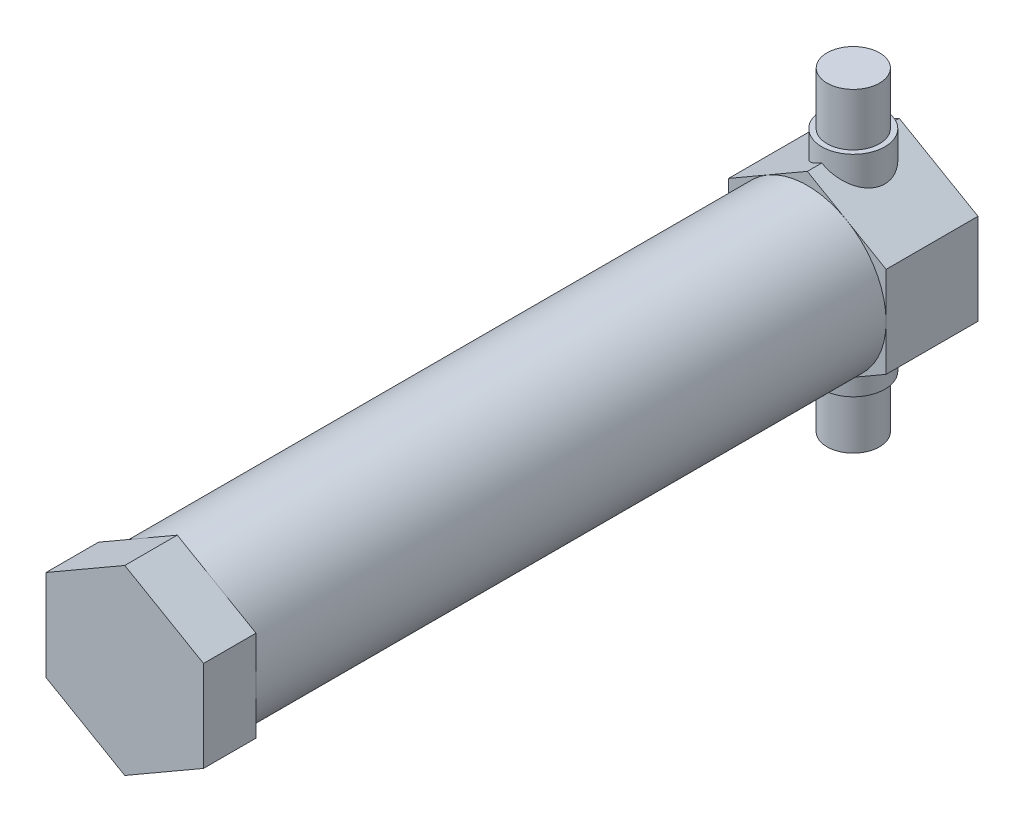
ISO-10303-21;
HEADER;
FILE_DESCRIPTION(('STEP AP214'),'2;1');
FILE_NAME('part.step','',(''),(''),'','','');
FILE_SCHEMA(('AUTOMOTIVE_DESIGN { 1 0 10303 214 1 1 1 1 }'));
ENDSEC;
DATA;
#1=APPLICATION_CONTEXT('core data for automotive mechanical design processes');
#2=APPLICATION_PROTOCOL_DEFINITION('international standard','automotive_design',2000,#1);
#3=PRODUCT_CONTEXT('',#1,'mechanical');
#4=PRODUCT('Part','Part','',(#3));
#5=PRODUCT_RELATED_PRODUCT_CATEGORY('part','',(#4));
#6=PRODUCT_DEFINITION_FORMATION('','',#4);
#7=PRODUCT_DEFINITION_CONTEXT('part definition',#1,'design');
#8=PRODUCT_DEFINITION('design','',#6,#7);
#9=PRODUCT_DEFINITION_SHAPE('','',#8);
#10=(LENGTH_UNIT() NAMED_UNIT(*) SI_UNIT(.MILLI.,.METRE.));
#11=(NAMED_UNIT(*) PLANE_ANGLE_UNIT() SI_UNIT($,.RADIAN.));
#12=(NAMED_UNIT(*) SI_UNIT($,.STERADIAN.) SOLID_ANGLE_UNIT());
#13=UNCERTAINTY_MEASURE_WITH_UNIT(LENGTH_MEASURE(1.E-05),#10,'distance_accuracy_value','');
#14=(GEOMETRIC_REPRESENTATION_CONTEXT(3) GLOBAL_UNCERTAINTY_ASSIGNED_CONTEXT((#13)) GLOBAL_UNIT_ASSIGNED_CONTEXT((#10,
#11,#12)) REPRESENTATION_CONTEXT('',''));
#15=CARTESIAN_POINT('',(0.,0.,0.));
#16=DIRECTION('',(0.,0.,1.));
#17=DIRECTION('',(1.,0.,0.));
#18=AXIS2_PLACEMENT_3D('',#15,#16,#17);
#19=CARTESIAN_POINT('',(0.,0.,93.6625));
#20=DIRECTION('',(0.,0.,-1.));
#21=DIRECTION('',(-1.,0.,0.));
#22=AXIS2_PLACEMENT_3D('',#19,#20,#21);
#23=CYLINDRICAL_SURFACE('',#22,9.525);
#24=CARTESIAN_POINT('',(0.,0.,87.3125));
#25=DIRECTION('',(0.,0.,1.));
#26=DIRECTION('',(1.,0.,0.));
#27=AXIS2_PLACEMENT_3D('',#24,#25,#26);
#28=CIRCLE('',#27,9.525);
#29=CARTESIAN_POINT('',(9.525,0.,87.3125));
#30=VERTEX_POINT('',#29);
#31=CARTESIAN_POINT('',(4.7625,8.24889197104678,87.3125));
#32=VERTEX_POINT('',#31);
#33=EDGE_CURVE('E260',#30,#32,#28,.T.);
#34=ORIENTED_EDGE('',*,*,#33,.F.);
#35=CARTESIAN_POINT('',(4.7625,-8.24889197104678,87.3125));
#36=VERTEX_POINT('',#35);
#37=EDGE_CURVE('E242',#36,#30,#28,.T.);
#38=ORIENTED_EDGE('',*,*,#37,.F.);
#39=CARTESIAN_POINT('',(-4.7625,-8.24889197104678,87.3125));
#40=VERTEX_POINT('',#39);
#41=EDGE_CURVE('E259',#40,#36,#28,.T.);
#42=ORIENTED_EDGE('',*,*,#41,.F.);
#43=CARTESIAN_POINT('',(-9.525,0.,87.3125));
#44=VERTEX_POINT('',#43);
#45=EDGE_CURVE('E435',#44,#40,#28,.T.);
#46=ORIENTED_EDGE('',*,*,#45,.F.);
#47=CARTESIAN_POINT('',(-4.7625,8.24889197104678,87.3125));
#48=VERTEX_POINT('',#47);
#49=EDGE_CURVE('E436',#48,#44,#28,.T.);
#50=ORIENTED_EDGE('',*,*,#49,.F.);
#51=EDGE_CURVE('E414',#32,#48,#28,.T.);
#52=ORIENTED_EDGE('',*,*,#51,.F.);
#53=EDGE_LOOP('',(#34,#38,#42,#46,#50,#52));
#54=FACE_BOUND('',#53,.T.);
#55=CARTESIAN_POINT('',(0.,0.,11.1125));
#56=DIRECTION('',(0.,0.,-1.));
#57=DIRECTION('',(-1.,0.,0.));
#58=AXIS2_PLACEMENT_3D('',#55,#56,#57);
#59=CIRCLE('',#58,9.525);
#60=CARTESIAN_POINT('',(-9.525,0.,11.1125));
#61=VERTEX_POINT('',#60);
#62=CARTESIAN_POINT('',(-4.7625,8.24889197104678,11.1125));
#63=VERTEX_POINT('',#62);
#64=EDGE_CURVE('E265',#61,#63,#59,.T.);
#65=ORIENTED_EDGE('',*,*,#64,.F.);
#66=CARTESIAN_POINT('',(-4.7625,-8.24889197104678,11.1125));
#67=VERTEX_POINT('',#66);
#68=EDGE_CURVE('E261',#67,#61,#59,.T.);
#69=ORIENTED_EDGE('',*,*,#68,.F.);
#70=CARTESIAN_POINT('',(4.7625,-8.24889197104678,11.1125));
#71=VERTEX_POINT('',#70);
#72=EDGE_CURVE('E264',#71,#67,#59,.T.);
#73=ORIENTED_EDGE('',*,*,#72,.F.);
#74=CARTESIAN_POINT('',(9.525,0.,11.1125));
#75=VERTEX_POINT('',#74);
#76=EDGE_CURVE('E370',#75,#71,#59,.T.);
#77=ORIENTED_EDGE('',*,*,#76,.F.);
#78=CARTESIAN_POINT('',(4.7625,8.24889197104678,11.1125));
#79=VERTEX_POINT('',#78);
#80=EDGE_CURVE('E359',#79,#75,#59,.T.);
#81=ORIENTED_EDGE('',*,*,#80,.F.);
#82=EDGE_CURVE('E354',#63,#79,#59,.T.);
#83=ORIENTED_EDGE('',*,*,#82,.F.);
#84=EDGE_LOOP('',(#65,#69,#73,#77,#81,#83));
#85=FACE_BOUND('',#84,.T.);
#86=ADVANCED_FACE('F41',(#54,#85),#23,.T.);
#87=CARTESIAN_POINT('',(0.,0.,87.3125));
#88=DIRECTION('',(0.,0.,1.));
#89=DIRECTION('',(1.,0.,0.));
#90=AXIS2_PLACEMENT_3D('',#87,#88,#89);
#91=PLANE('',#90);
#92=DIRECTION('',(0.,1.,0.));
#93=VECTOR('',#92,1.);
#94=CARTESIAN_POINT('',(9.525,-5.49926131403118,87.3125));
#95=LINE('',#94,#93);
#96=CARTESIAN_POINT('',(9.525,5.49926131403119,87.3125));
#97=VERTEX_POINT('',#96);
#98=EDGE_CURVE('E205',#30,#97,#95,.T.);
#99=ORIENTED_EDGE('',*,*,#98,.F.);
#100=ORIENTED_EDGE('',*,*,#33,.T.);
#101=DIRECTION('',(-0.866025403784438,0.5,0.));
#102=VECTOR('',#101,1.);
#103=CARTESIAN_POINT('',(9.525,5.49926131403119,87.3125));
#104=LINE('',#103,#102);
#105=EDGE_CURVE('E206',#97,#32,#104,.T.);
#106=ORIENTED_EDGE('',*,*,#105,.F.);
#107=EDGE_LOOP('',(#99,#100,#106));
#108=FACE_BOUND('',#107,.T.);
#109=ADVANCED_FACE('F400',(#108),#91,.F.);
#110=CARTESIAN_POINT('',(0.,10.9985226280624,87.3125));
#111=VERTEX_POINT('',#110);
#112=EDGE_CURVE('E204',#32,#111,#104,.T.);
#113=ORIENTED_EDGE('',*,*,#112,.F.);
#114=ORIENTED_EDGE('',*,*,#51,.T.);
#115=DIRECTION('',(-0.866025403784438,-0.5,0.));
#116=VECTOR('',#115,1.);
#117=CARTESIAN_POINT('',(0.,10.9985226280624,87.3125));
#118=LINE('',#117,#116);
#119=EDGE_CURVE('E210',#111,#48,#118,.T.);
#120=ORIENTED_EDGE('',*,*,#119,.F.);
#121=EDGE_LOOP('',(#113,#114,#120));
#122=FACE_BOUND('',#121,.T.);
#123=ADVANCED_FACE('F407',(#122),#91,.F.);
#124=CARTESIAN_POINT('',(-9.525,5.49926131403119,87.3125));
#125=VERTEX_POINT('',#124);
#126=EDGE_CURVE('E209',#48,#125,#118,.T.);
#127=ORIENTED_EDGE('',*,*,#126,.F.);
#128=ORIENTED_EDGE('',*,*,#49,.T.);
#129=DIRECTION('',(0.,-1.,0.));
#130=VECTOR('',#129,1.);
#131=CARTESIAN_POINT('',(-9.525,5.49926131403119,87.3125));
#132=LINE('',#131,#130);
#133=EDGE_CURVE('E214',#125,#44,#132,.T.);
#134=ORIENTED_EDGE('',*,*,#133,.F.);
#135=EDGE_LOOP('',(#127,#128,#134));
#136=FACE_BOUND('',#135,.T.);
#137=ADVANCED_FACE('F446',(#136),#91,.F.);
#138=CARTESIAN_POINT('',(-9.525,-5.49926131403118,87.3125));
#139=VERTEX_POINT('',#138);
#140=EDGE_CURVE('E213',#44,#139,#132,.T.);
#141=ORIENTED_EDGE('',*,*,#140,.F.);
#142=ORIENTED_EDGE('',*,*,#45,.T.);
#143=DIRECTION('',(0.866025403784438,-0.5,0.));
#144=VECTOR('',#143,1.);
#145=CARTESIAN_POINT('',(-9.525,-5.49926131403118,87.3125));
#146=LINE('',#145,#144);
#147=EDGE_CURVE('E218',#139,#40,#146,.T.);
#148=ORIENTED_EDGE('',*,*,#147,.F.);
#149=EDGE_LOOP('',(#141,#142,#148));
#150=FACE_BOUND('',#149,.T.);
#151=ADVANCED_FACE('F462',(#150),#91,.F.);
#152=CARTESIAN_POINT('',(0.,-10.9985226280624,87.3125));
#153=VERTEX_POINT('',#152);
#154=EDGE_CURVE('E217',#40,#153,#146,.T.);
#155=ORIENTED_EDGE('',*,*,#154,.F.);
#156=ORIENTED_EDGE('',*,*,#41,.T.);
#157=DIRECTION('',(0.866025403784439,0.5,0.));
#158=VECTOR('',#157,1.);
#159=CARTESIAN_POINT('',(0.,-10.9985226280624,87.3125));
#160=LINE('',#159,#158);
#161=EDGE_CURVE('E222',#153,#36,#160,.T.);
#162=ORIENTED_EDGE('',*,*,#161,.F.);
#163=EDGE_LOOP('',(#155,#156,#162));
#164=FACE_BOUND('',#163,.T.);
#165=ADVANCED_FACE('F433',(#164),#91,.F.);
#166=CARTESIAN_POINT('',(9.525,-5.49926131403118,87.3125));
#167=DIRECTION('',(1.,0.,0.));
#168=DIRECTION('',(0.,0.,-1.));
#169=AXIS2_PLACEMENT_3D('',#166,#167,#168);
#170=PLANE('',#169);
#171=CARTESIAN_POINT('',(9.525,-5.49926131403118,87.3125));
#172=VERTEX_POINT('',#171);
#173=EDGE_CURVE('E201',#172,#30,#95,.T.);
#174=ORIENTED_EDGE('',*,*,#173,.T.);
#175=ORIENTED_EDGE('',*,*,#98,.T.);
#176=DIRECTION('',(0.,0.,1.));
#177=VECTOR('',#176,1.);
#178=CARTESIAN_POINT('',(9.525,5.49926131403119,87.3125));
#179=LINE('',#178,#177);
#180=CARTESIAN_POINT('',(9.525,5.49926131403119,93.6625));
#181=VERTEX_POINT('',#180);
#182=EDGE_CURVE('E225',#97,#181,#179,.T.);
#183=ORIENTED_EDGE('',*,*,#182,.T.);
#184=DIRECTION('',(0.,1.,0.));
#185=VECTOR('',#184,1.);
#186=CARTESIAN_POINT('',(9.525,-5.49926131403118,93.6625));
#187=LINE('',#186,#185);
#188=CARTESIAN_POINT('',(9.525,-5.49926131403118,93.6625));
#189=VERTEX_POINT('',#188);
#190=EDGE_CURVE('E226',#189,#181,#187,.T.);
#191=ORIENTED_EDGE('',*,*,#190,.F.);
#192=DIRECTION('',(0.,0.,1.));
#193=VECTOR('',#192,1.);
#194=CARTESIAN_POINT('',(9.525,-5.49926131403118,87.3125));
#195=LINE('',#194,#193);
#196=EDGE_CURVE('E239',#172,#189,#195,.T.);
#197=ORIENTED_EDGE('',*,*,#196,.F.);
#198=EDGE_LOOP('',(#174,#175,#183,#191,#197));
#199=FACE_BOUND('',#198,.T.);
#200=ADVANCED_FACE('F424',(#199),#170,.T.);
#201=CARTESIAN_POINT('',(0.,-10.9985226280624,87.3125));
#202=DIRECTION('',(0.5,-0.866025403784439,0.));
#203=DIRECTION('',(0.866025403784439,0.5,0.));
#204=AXIS2_PLACEMENT_3D('',#201,#202,#203);
#205=PLANE('',#204);
#206=ORIENTED_EDGE('',*,*,#161,.T.);
#207=EDGE_CURVE('E221',#36,#172,#160,.T.);
#208=ORIENTED_EDGE('',*,*,#207,.T.);
#209=ORIENTED_EDGE('',*,*,#196,.T.);
#210=DIRECTION('',(0.866025403784439,0.5,0.));
#211=VECTOR('',#210,1.);
#212=CARTESIAN_POINT('',(0.,-10.9985226280624,93.6625));
#213=LINE('',#212,#211);
#214=CARTESIAN_POINT('',(0.,-10.9985226280624,93.6625));
#215=VERTEX_POINT('',#214);
#216=EDGE_CURVE('E237',#215,#189,#213,.T.);
#217=ORIENTED_EDGE('',*,*,#216,.F.);
#218=DIRECTION('',(0.,0.,1.));
#219=VECTOR('',#218,1.);
#220=CARTESIAN_POINT('',(0.,-10.9985226280624,87.3125));
#221=LINE('',#220,#219);
#222=EDGE_CURVE('E243',#153,#215,#221,.T.);
#223=ORIENTED_EDGE('',*,*,#222,.F.);
#224=EDGE_LOOP('',(#206,#208,#209,#217,#223));
#225=FACE_BOUND('',#224,.T.);
#226=ADVANCED_FACE('F428',(#225),#205,.T.);
#227=CARTESIAN_POINT('',(-9.525,-5.49926131403118,87.3125));
#228=DIRECTION('',(-0.5,-0.866025403784438,0.));
#229=DIRECTION('',(0.866025403784439,-0.5,0.));
#230=AXIS2_PLACEMENT_3D('',#227,#228,#229);
#231=PLANE('',#230);
#232=ORIENTED_EDGE('',*,*,#147,.T.);
#233=ORIENTED_EDGE('',*,*,#154,.T.);
#234=ORIENTED_EDGE('',*,*,#222,.T.);
#235=DIRECTION('',(0.866025403784438,-0.5,0.));
#236=VECTOR('',#235,1.);
#237=CARTESIAN_POINT('',(-9.525,-5.49926131403118,93.6625));
#238=LINE('',#237,#236);
#239=CARTESIAN_POINT('',(-9.525,-5.49926131403118,93.6625));
#240=VERTEX_POINT('',#239);
#241=EDGE_CURVE('E235',#240,#215,#238,.T.);
#242=ORIENTED_EDGE('',*,*,#241,.F.);
#243=DIRECTION('',(0.,0.,1.));
#244=VECTOR('',#243,1.);
#245=CARTESIAN_POINT('',(-9.525,-5.49926131403118,87.3125));
#246=LINE('',#245,#244);
#247=EDGE_CURVE('E246',#139,#240,#246,.T.);
#248=ORIENTED_EDGE('',*,*,#247,.F.);
#249=EDGE_LOOP('',(#232,#233,#234,#242,#248));
#250=FACE_BOUND('',#249,.T.);
#251=ADVANCED_FACE('F461',(#250),#231,.T.);
#252=CARTESIAN_POINT('',(-9.525,5.49926131403119,87.3125));
#253=DIRECTION('',(-1.,0.,0.));
#254=DIRECTION('',(0.,0.,1.));
#255=AXIS2_PLACEMENT_3D('',#252,#253,#254);
#256=PLANE('',#255);
#257=ORIENTED_EDGE('',*,*,#133,.T.);
#258=ORIENTED_EDGE('',*,*,#140,.T.);
#259=ORIENTED_EDGE('',*,*,#247,.T.);
#260=DIRECTION('',(0.,-1.,0.));
#261=VECTOR('',#260,1.);
#262=CARTESIAN_POINT('',(-9.525,5.49926131403119,93.6625));
#263=LINE('',#262,#261);
#264=CARTESIAN_POINT('',(-9.525,5.49926131403119,93.6625));
#265=VERTEX_POINT('',#264);
#266=EDGE_CURVE('E233',#265,#240,#263,.T.);
#267=ORIENTED_EDGE('',*,*,#266,.F.);
#268=DIRECTION('',(0.,0.,1.));
#269=VECTOR('',#268,1.);
#270=CARTESIAN_POINT('',(-9.525,5.49926131403119,87.3125));
#271=LINE('',#270,#269);
#272=EDGE_CURVE('E249',#125,#265,#271,.T.);
#273=ORIENTED_EDGE('',*,*,#272,.F.);
#274=EDGE_LOOP('',(#257,#258,#259,#267,#273));
#275=FACE_BOUND('',#274,.T.);
#276=ADVANCED_FACE('F464',(#275),#256,.T.);
#277=CARTESIAN_POINT('',(0.,10.9985226280624,87.3125));
#278=DIRECTION('',(-0.5,0.866025403784438,0.));
#279=DIRECTION('',(-0.866025403784439,-0.5,0.));
#280=AXIS2_PLACEMENT_3D('',#277,#278,#279);
#281=PLANE('',#280);
#282=ORIENTED_EDGE('',*,*,#119,.T.);
#283=ORIENTED_EDGE('',*,*,#126,.T.);
#284=ORIENTED_EDGE('',*,*,#272,.T.);
#285=DIRECTION('',(-0.866025403784438,-0.5,0.));
#286=VECTOR('',#285,1.);
#287=CARTESIAN_POINT('',(0.,10.9985226280624,93.6625));
#288=LINE('',#287,#286);
#289=CARTESIAN_POINT('',(0.,10.9985226280624,93.6625));
#290=VERTEX_POINT('',#289);
#291=EDGE_CURVE('E231',#290,#265,#288,.T.);
#292=ORIENTED_EDGE('',*,*,#291,.F.);
#293=DIRECTION('',(0.,0.,1.));
#294=VECTOR('',#293,1.);
#295=CARTESIAN_POINT('',(0.,10.9985226280624,87.3125));
#296=LINE('',#295,#294);
#297=EDGE_CURVE('E252',#111,#290,#296,.T.);
#298=ORIENTED_EDGE('',*,*,#297,.F.);
#299=EDGE_LOOP('',(#282,#283,#284,#292,#298));
#300=FACE_BOUND('',#299,.T.);
#301=ADVANCED_FACE('F450',(#300),#281,.T.);
#302=CARTESIAN_POINT('',(9.525,5.49926131403119,87.3125));
#303=DIRECTION('',(0.5,0.866025403784438,0.));
#304=DIRECTION('',(-0.866025403784439,0.5,0.));
#305=AXIS2_PLACEMENT_3D('',#302,#303,#304);
#306=PLANE('',#305);
#307=ORIENTED_EDGE('',*,*,#105,.T.);
#308=ORIENTED_EDGE('',*,*,#112,.T.);
#309=ORIENTED_EDGE('',*,*,#297,.T.);
#310=DIRECTION('',(-0.866025403784438,0.5,0.));
#311=VECTOR('',#310,1.);
#312=CARTESIAN_POINT('',(9.525,5.49926131403119,93.6625));
#313=LINE('',#312,#311);
#314=EDGE_CURVE('E228',#181,#290,#313,.T.);
#315=ORIENTED_EDGE('',*,*,#314,.F.);
#316=ORIENTED_EDGE('',*,*,#182,.F.);
#317=EDGE_LOOP('',(#307,#308,#309,#315,#316));
#318=FACE_BOUND('',#317,.T.);
#319=ADVANCED_FACE('F454',(#318),#306,.T.);
#320=ORIENTED_EDGE('',*,*,#207,.F.);
#321=ORIENTED_EDGE('',*,*,#37,.T.);
#322=ORIENTED_EDGE('',*,*,#173,.F.);
#323=EDGE_LOOP('',(#320,#321,#322));
#324=FACE_BOUND('',#323,.T.);
#325=ADVANCED_FACE('F410',(#324),#91,.F.);
#326=CARTESIAN_POINT('',(0.,0.,93.6625));
#327=DIRECTION('',(0.,0.,1.));
#328=DIRECTION('',(1.,0.,0.));
#329=AXIS2_PLACEMENT_3D('',#326,#327,#328);
#330=PLANE('',#329);
#331=ORIENTED_EDGE('',*,*,#216,.T.);
#332=ORIENTED_EDGE('',*,*,#190,.T.);
#333=ORIENTED_EDGE('',*,*,#314,.T.);
#334=ORIENTED_EDGE('',*,*,#291,.T.);
#335=ORIENTED_EDGE('',*,*,#266,.T.);
#336=ORIENTED_EDGE('',*,*,#241,.T.);
#337=EDGE_LOOP('',(#331,#332,#333,#334,#335,#336));
#338=FACE_BOUND('',#337,.T.);
#339=ADVANCED_FACE('F456',(#338),#330,.T.);
#340=CARTESIAN_POINT('',(0.,0.,11.1125));
#341=DIRECTION('',(0.,0.,-1.));
#342=DIRECTION('',(-1.,0.,0.));
#343=AXIS2_PLACEMENT_3D('',#340,#341,#342);
#344=PLANE('',#343);
#345=DIRECTION('',(0.,1.,0.));
#346=VECTOR('',#345,1.);
#347=CARTESIAN_POINT('',(-9.525,-5.49926131403119,11.1125));
#348=LINE('',#347,#346);
#349=CARTESIAN_POINT('',(-9.525,5.49926131403119,11.1125));
#350=VERTEX_POINT('',#349);
#351=EDGE_CURVE('E196',#61,#350,#348,.T.);
#352=ORIENTED_EDGE('',*,*,#351,.F.);
#353=ORIENTED_EDGE('',*,*,#64,.T.);
#354=DIRECTION('',(0.866025403784439,0.5,0.));
#355=VECTOR('',#354,1.);
#356=CARTESIAN_POINT('',(-9.525,5.49926131403119,11.1125));
#357=LINE('',#356,#355);
#358=EDGE_CURVE('E292',#350,#63,#357,.T.);
#359=ORIENTED_EDGE('',*,*,#358,.F.);
#360=EDGE_LOOP('',(#352,#353,#359));
#361=FACE_BOUND('',#360,.T.);
#362=ADVANCED_FACE('F351',(#361),#344,.F.);
#363=CARTESIAN_POINT('',(0.,10.9985226280624,11.1125));
#364=VERTEX_POINT('',#363);
#365=EDGE_CURVE('E296',#63,#364,#357,.T.);
#366=ORIENTED_EDGE('',*,*,#365,.F.);
#367=ORIENTED_EDGE('',*,*,#82,.T.);
#368=DIRECTION('',(0.866025403784439,-0.5,0.));
#369=VECTOR('',#368,1.);
#370=CARTESIAN_POINT('',(0.,10.9985226280624,11.1125));
#371=LINE('',#370,#369);
#372=EDGE_CURVE('E297',#364,#79,#371,.T.);
#373=ORIENTED_EDGE('',*,*,#372,.F.);
#374=EDGE_LOOP('',(#366,#367,#373));
#375=FACE_BOUND('',#374,.T.);
#376=ADVANCED_FACE('F358',(#375),#344,.F.);
#377=CARTESIAN_POINT('',(9.525,5.49926131403119,11.1125));
#378=VERTEX_POINT('',#377);
#379=EDGE_CURVE('E295',#79,#378,#371,.T.);
#380=ORIENTED_EDGE('',*,*,#379,.F.);
#381=ORIENTED_EDGE('',*,*,#80,.T.);
#382=DIRECTION('',(0.,-1.,0.));
#383=VECTOR('',#382,1.);
#384=CARTESIAN_POINT('',(9.525,5.49926131403119,11.1125));
#385=LINE('',#384,#383);
#386=EDGE_CURVE('E301',#378,#75,#385,.T.);
#387=ORIENTED_EDGE('',*,*,#386,.F.);
#388=EDGE_LOOP('',(#380,#381,#387));
#389=FACE_BOUND('',#388,.T.);
#390=ADVANCED_FACE('F362',(#389),#344,.F.);
#391=CARTESIAN_POINT('',(9.525,-5.49926131403119,11.1125));
#392=VERTEX_POINT('',#391);
#393=EDGE_CURVE('E300',#75,#392,#385,.T.);
#394=ORIENTED_EDGE('',*,*,#393,.F.);
#395=ORIENTED_EDGE('',*,*,#76,.T.);
#396=DIRECTION('',(-0.866025403784439,-0.5,0.));
#397=VECTOR('',#396,1.);
#398=CARTESIAN_POINT('',(9.525,-5.49926131403119,11.1125));
#399=LINE('',#398,#397);
#400=EDGE_CURVE('E305',#392,#71,#399,.T.);
#401=ORIENTED_EDGE('',*,*,#400,.F.);
#402=EDGE_LOOP('',(#394,#395,#401));
#403=FACE_BOUND('',#402,.T.);
#404=ADVANCED_FACE('F369',(#403),#344,.F.);
#405=CARTESIAN_POINT('',(0.,-10.9985226280624,11.1125));
#406=VERTEX_POINT('',#405);
#407=EDGE_CURVE('E304',#71,#406,#399,.T.);
#408=ORIENTED_EDGE('',*,*,#407,.F.);
#409=ORIENTED_EDGE('',*,*,#72,.T.);
#410=DIRECTION('',(-0.866025403784439,0.5,0.));
#411=VECTOR('',#410,1.);
#412=CARTESIAN_POINT('',(0.,-10.9985226280624,11.1125));
#413=LINE('',#412,#411);
#414=EDGE_CURVE('E309',#406,#67,#413,.T.);
#415=ORIENTED_EDGE('',*,*,#414,.F.);
#416=EDGE_LOOP('',(#408,#409,#415));
#417=FACE_BOUND('',#416,.T.);
#418=ADVANCED_FACE('F375',(#417),#344,.F.);
#419=CARTESIAN_POINT('',(-9.525,5.49926131403119,11.1125));
#420=DIRECTION('',(-0.5,0.866025403784439,0.));
#421=DIRECTION('',(-0.866025403784439,-0.5,0.));
#422=AXIS2_PLACEMENT_3D('',#419,#420,#421);
#423=PLANE('',#422);
#424=DIRECTION('',(0.,0.,-1.));
#425=VECTOR('',#424,1.);
#426=CARTESIAN_POINT('',(0.,10.9985226280624,11.1125));
#427=LINE('',#426,#425);
#428=CARTESIAN_POINT('',(0.,10.9985226280624,9.36625));
#429=VERTEX_POINT('',#428);
#430=EDGE_CURVE('E184',#364,#429,#427,.T.);
#431=ORIENTED_EDGE('',*,*,#430,.T.);
#432=CARTESIAN_POINT('',(0.,10.9985226280624,5.55625));
#433=DIRECTION('',(-0.5,0.866025403784439,0.));
#434=DIRECTION('',(-0.866025403784439,-0.5,0.));
#435=AXIS2_PLACEMENT_3D('',#432,#433,#434);
#436=ELLIPSE('',#435,4.39940905122495,3.81);
#437=CARTESIAN_POINT('',(0.,10.9985226280624,1.74625));
#438=VERTEX_POINT('',#437);
#439=EDGE_CURVE('E61',#429,#438,#436,.F.);
#440=ORIENTED_EDGE('',*,*,#439,.T.);
#441=CARTESIAN_POINT('',(0.,10.9985226280624,0.));
#442=VERTEX_POINT('',#441);
#443=EDGE_CURVE('E182',#438,#442,#427,.T.);
#444=ORIENTED_EDGE('',*,*,#443,.T.);
#445=DIRECTION('',(0.866025403784439,0.5,0.));
#446=VECTOR('',#445,1.);
#447=CARTESIAN_POINT('',(-9.525,5.49926131403119,0.));
#448=LINE('',#447,#446);
#449=CARTESIAN_POINT('',(-9.525,5.49926131403119,0.));
#450=VERTEX_POINT('',#449);
#451=EDGE_CURVE('E289',#450,#442,#448,.T.);
#452=ORIENTED_EDGE('',*,*,#451,.F.);
#453=DIRECTION('',(0.,0.,-1.));
#454=VECTOR('',#453,1.);
#455=CARTESIAN_POINT('',(-9.525,5.49926131403119,11.1125));
#456=LINE('',#455,#454);
#457=EDGE_CURVE('E229',#350,#450,#456,.T.);
#458=ORIENTED_EDGE('',*,*,#457,.F.);
#459=ORIENTED_EDGE('',*,*,#358,.T.);
#460=ORIENTED_EDGE('',*,*,#365,.T.);
#461=EDGE_LOOP('',(#431,#440,#444,#452,#458,#459,#460));
#462=FACE_BOUND('',#461,.T.);
#463=ADVANCED_FACE('F180',(#462),#423,.T.);
#464=CARTESIAN_POINT('',(-9.525,-5.49926131403119,11.1125));
#465=DIRECTION('',(-1.,0.,0.));
#466=DIRECTION('',(0.,-1.,0.));
#467=AXIS2_PLACEMENT_3D('',#464,#465,#466);
#468=PLANE('',#467);
#469=DIRECTION('',(0.,1.,0.));
#470=VECTOR('',#469,1.);
#471=CARTESIAN_POINT('',(-9.525,-5.49926131403119,0.));
#472=LINE('',#471,#470);
#473=CARTESIAN_POINT('',(-9.525,-5.49926131403119,0.));
#474=VERTEX_POINT('',#473);
#475=EDGE_CURVE('E322',#474,#450,#472,.T.);
#476=ORIENTED_EDGE('',*,*,#475,.F.);
#477=DIRECTION('',(0.,0.,-1.));
#478=VECTOR('',#477,1.);
#479=CARTESIAN_POINT('',(-9.525,-5.49926131403119,11.1125));
#480=LINE('',#479,#478);
#481=CARTESIAN_POINT('',(-9.525,-5.49926131403119,11.1125));
#482=VERTEX_POINT('',#481);
#483=EDGE_CURVE('E326',#482,#474,#480,.T.);
#484=ORIENTED_EDGE('',*,*,#483,.F.);
#485=EDGE_CURVE('E192',#482,#61,#348,.T.);
#486=ORIENTED_EDGE('',*,*,#485,.T.);
#487=ORIENTED_EDGE('',*,*,#351,.T.);
#488=ORIENTED_EDGE('',*,*,#457,.T.);
#489=EDGE_LOOP('',(#476,#484,#486,#487,#488));
#490=FACE_BOUND('',#489,.T.);
#491=ADVANCED_FACE('F573',(#490),#468,.T.);
#492=CARTESIAN_POINT('',(0.,-10.9985226280624,11.1125));
#493=DIRECTION('',(-0.5,-0.866025403784438,0.));
#494=DIRECTION('',(0.866025403784439,-0.5,0.));
#495=AXIS2_PLACEMENT_3D('',#492,#493,#494);
#496=PLANE('',#495);
#497=DIRECTION('',(0.,0.,-1.));
#498=VECTOR('',#497,1.);
#499=CARTESIAN_POINT('',(0.,-10.9985226280624,11.1125));
#500=LINE('',#499,#498);
#501=CARTESIAN_POINT('',(0.,-10.9985226280624,1.74625));
#502=VERTEX_POINT('',#501);
#503=CARTESIAN_POINT('',(0.,-10.9985226280624,0.));
#504=VERTEX_POINT('',#503);
#505=EDGE_CURVE('E331',#502,#504,#500,.T.);
#506=ORIENTED_EDGE('',*,*,#505,.F.);
#507=CARTESIAN_POINT('',(0.,-10.9985226280624,5.55625));
#508=DIRECTION('',(-0.5,-0.866025403784438,0.));
#509=DIRECTION('',(0.866025403784439,-0.5,0.));
#510=AXIS2_PLACEMENT_3D('',#507,#508,#509);
#511=ELLIPSE('',#510,4.39940905122495,3.81);
#512=CARTESIAN_POINT('',(0.,-10.9985226280624,9.36625));
#513=VERTEX_POINT('',#512);
#514=EDGE_CURVE('E54',#502,#513,#511,.F.);
#515=ORIENTED_EDGE('',*,*,#514,.T.);
#516=EDGE_CURVE('E329',#406,#513,#500,.T.);
#517=ORIENTED_EDGE('',*,*,#516,.F.);
#518=ORIENTED_EDGE('',*,*,#414,.T.);
#519=EDGE_CURVE('E308',#67,#482,#413,.T.);
#520=ORIENTED_EDGE('',*,*,#519,.T.);
#521=ORIENTED_EDGE('',*,*,#483,.T.);
#522=DIRECTION('',(-0.866025403784439,0.5,0.));
#523=VECTOR('',#522,1.);
#524=CARTESIAN_POINT('',(0.,-10.9985226280624,0.));
#525=LINE('',#524,#523);
#526=EDGE_CURVE('E319',#504,#474,#525,.T.);
#527=ORIENTED_EDGE('',*,*,#526,.F.);
#528=EDGE_LOOP('',(#506,#515,#517,#518,#520,#521,#527));
#529=FACE_BOUND('',#528,.T.);
#530=ADVANCED_FACE('F380',(#529),#496,.T.);
#531=CARTESIAN_POINT('',(9.525,-5.49926131403119,11.1125));
#532=DIRECTION('',(0.5,-0.866025403784439,0.));
#533=DIRECTION('',(0.866025403784439,0.5,0.));
#534=AXIS2_PLACEMENT_3D('',#531,#532,#533);
#535=PLANE('',#534);
#536=ORIENTED_EDGE('',*,*,#516,.T.);
#537=CARTESIAN_POINT('',(0.,-10.9985226280624,5.55625));
#538=DIRECTION('',(0.5,-0.866025403784439,0.));
#539=DIRECTION('',(-0.866025403784439,-0.5,0.));
#540=AXIS2_PLACEMENT_3D('',#537,#538,#539);
#541=ELLIPSE('',#540,4.39940905122495,3.81);
#542=EDGE_CURVE('E185',#513,#502,#541,.F.);
#543=ORIENTED_EDGE('',*,*,#542,.T.);
#544=ORIENTED_EDGE('',*,*,#505,.T.);
#545=DIRECTION('',(-0.866025403784439,-0.5,0.));
#546=VECTOR('',#545,1.);
#547=CARTESIAN_POINT('',(9.525,-5.49926131403119,0.));
#548=LINE('',#547,#546);
#549=CARTESIAN_POINT('',(9.525,-5.49926131403119,0.));
#550=VERTEX_POINT('',#549);
#551=EDGE_CURVE('E316',#550,#504,#548,.T.);
#552=ORIENTED_EDGE('',*,*,#551,.F.);
#553=DIRECTION('',(0.,0.,-1.));
#554=VECTOR('',#553,1.);
#555=CARTESIAN_POINT('',(9.525,-5.49926131403119,11.1125));
#556=LINE('',#555,#554);
#557=EDGE_CURVE('E332',#392,#550,#556,.T.);
#558=ORIENTED_EDGE('',*,*,#557,.F.);
#559=ORIENTED_EDGE('',*,*,#400,.T.);
#560=ORIENTED_EDGE('',*,*,#407,.T.);
#561=EDGE_LOOP('',(#536,#543,#544,#552,#558,#559,#560));
#562=FACE_BOUND('',#561,.T.);
#563=ADVANCED_FACE('F368',(#562),#535,.T.);
#564=CARTESIAN_POINT('',(9.525,5.49926131403119,11.1125));
#565=DIRECTION('',(1.,0.,0.));
#566=DIRECTION('',(0.,1.,0.));
#567=AXIS2_PLACEMENT_3D('',#564,#565,#566);
#568=PLANE('',#567);
#569=ORIENTED_EDGE('',*,*,#557,.T.);
#570=DIRECTION('',(0.,-1.,0.));
#571=VECTOR('',#570,1.);
#572=CARTESIAN_POINT('',(9.525,5.49926131403119,0.));
#573=LINE('',#572,#571);
#574=CARTESIAN_POINT('',(9.525,5.49926131403119,0.));
#575=VERTEX_POINT('',#574);
#576=EDGE_CURVE('E314',#575,#550,#573,.T.);
#577=ORIENTED_EDGE('',*,*,#576,.F.);
#578=DIRECTION('',(0.,0.,-1.));
#579=VECTOR('',#578,1.);
#580=CARTESIAN_POINT('',(9.525,5.49926131403119,11.1125));
#581=LINE('',#580,#579);
#582=EDGE_CURVE('E194',#378,#575,#581,.T.);
#583=ORIENTED_EDGE('',*,*,#582,.F.);
#584=ORIENTED_EDGE('',*,*,#386,.T.);
#585=ORIENTED_EDGE('',*,*,#393,.T.);
#586=EDGE_LOOP('',(#569,#577,#583,#584,#585));
#587=FACE_BOUND('',#586,.T.);
#588=ADVANCED_FACE('F341',(#587),#568,.T.);
#589=CARTESIAN_POINT('',(0.,10.9985226280624,11.1125));
#590=DIRECTION('',(0.5,0.866025403784438,0.));
#591=DIRECTION('',(-0.866025403784439,0.5,0.));
#592=AXIS2_PLACEMENT_3D('',#589,#590,#591);
#593=PLANE('',#592);
#594=ORIENTED_EDGE('',*,*,#443,.F.);
#595=CARTESIAN_POINT('',(0.,10.9985226280624,5.55625));
#596=DIRECTION('',(0.5,0.866025403784438,0.));
#597=DIRECTION('',(0.866025403784439,-0.5,0.));
#598=AXIS2_PLACEMENT_3D('',#595,#596,#597);
#599=ELLIPSE('',#598,4.39940905122495,3.81);
#600=EDGE_CURVE('E11',#438,#429,#599,.F.);
#601=ORIENTED_EDGE('',*,*,#600,.T.);
#602=ORIENTED_EDGE('',*,*,#430,.F.);
#603=ORIENTED_EDGE('',*,*,#372,.T.);
#604=ORIENTED_EDGE('',*,*,#379,.T.);
#605=ORIENTED_EDGE('',*,*,#582,.T.);
#606=DIRECTION('',(0.866025403784439,-0.5,0.));
#607=VECTOR('',#606,1.);
#608=CARTESIAN_POINT('',(0.,10.9985226280624,0.));
#609=LINE('',#608,#607);
#610=EDGE_CURVE('E191',#442,#575,#609,.T.);
#611=ORIENTED_EDGE('',*,*,#610,.F.);
#612=EDGE_LOOP('',(#594,#601,#602,#603,#604,#605,#611));
#613=FACE_BOUND('',#612,.T.);
#614=ADVANCED_FACE('F189',(#613),#593,.T.);
#615=ORIENTED_EDGE('',*,*,#519,.F.);
#616=ORIENTED_EDGE('',*,*,#68,.T.);
#617=ORIENTED_EDGE('',*,*,#485,.F.);
#618=EDGE_LOOP('',(#615,#616,#617));
#619=FACE_BOUND('',#618,.T.);
#620=ADVANCED_FACE('F396',(#619),#344,.F.);
#621=CARTESIAN_POINT('',(0.,0.,0.));
#622=DIRECTION('',(0.,0.,1.));
#623=DIRECTION('',(1.,0.,0.));
#624=AXIS2_PLACEMENT_3D('',#621,#622,#623);
#625=PLANE('',#624);
#626=CARTESIAN_POINT('',(0.,0.,0.));
#627=DIRECTION('',(0.,0.,-1.));
#628=DIRECTION('',(-1.,0.,0.));
#629=AXIS2_PLACEMENT_3D('',#626,#627,#628);
#630=CIRCLE('',#629,6.35);
#631=CARTESIAN_POINT('',(-6.35,0.,0.));
#632=VERTEX_POINT('',#631);
#633=EDGE_CURVE('E280',#632,#632,#630,.T.);
#634=ORIENTED_EDGE('',*,*,#633,.F.);
#635=EDGE_LOOP('',(#634));
#636=FACE_BOUND('',#635,.T.);
#637=ORIENTED_EDGE('',*,*,#526,.T.);
#638=ORIENTED_EDGE('',*,*,#475,.T.);
#639=ORIENTED_EDGE('',*,*,#451,.T.);
#640=ORIENTED_EDGE('',*,*,#610,.T.);
#641=ORIENTED_EDGE('',*,*,#576,.T.);
#642=ORIENTED_EDGE('',*,*,#551,.T.);
#643=EDGE_LOOP('',(#637,#638,#639,#640,#641,#642));
#644=FACE_BOUND('',#643,.T.);
#645=ADVANCED_FACE('F343',(#636,#644),#625,.F.);
#646=CARTESIAN_POINT('',(0.,-12.7,5.55625));
#647=DIRECTION('',(0.,1.,0.));
#648=DIRECTION('',(0.,0.,1.));
#649=AXIS2_PLACEMENT_3D('',#646,#647,#648);
#650=PLANE('',#649);
#651=CARTESIAN_POINT('',(0.,-12.7,5.55625));
#652=DIRECTION('',(0.,1.,0.));
#653=DIRECTION('',(0.,0.,1.));
#654=AXIS2_PLACEMENT_3D('',#651,#652,#653);
#655=CIRCLE('',#654,3.175);
#656=CARTESIAN_POINT('',(0.,-12.7,8.73125));
#657=VERTEX_POINT('',#656);
#658=EDGE_CURVE('E48',#657,#657,#655,.T.);
#659=ORIENTED_EDGE('',*,*,#658,.T.);
#660=EDGE_LOOP('',(#659));
#661=FACE_BOUND('',#660,.T.);
#662=CARTESIAN_POINT('',(0.,-12.7,5.55625));
#663=DIRECTION('',(0.,1.,0.));
#664=DIRECTION('',(0.,0.,1.));
#665=AXIS2_PLACEMENT_3D('',#662,#663,#664);
#666=CIRCLE('',#665,3.81);
#667=CARTESIAN_POINT('',(0.,-12.7,9.36625));
#668=VERTEX_POINT('',#667);
#669=EDGE_CURVE('E272',#668,#668,#666,.T.);
#670=ORIENTED_EDGE('',*,*,#669,.F.);
#671=EDGE_LOOP('',(#670));
#672=FACE_BOUND('',#671,.T.);
#673=ADVANCED_FACE('F385',(#661,#672),#650,.F.);
#674=CARTESIAN_POINT('',(0.,12.7,5.55625));
#675=DIRECTION('',(0.,-1.,0.));
#676=DIRECTION('',(0.,0.,-1.));
#677=AXIS2_PLACEMENT_3D('',#674,#675,#676);
#678=CYLINDRICAL_SURFACE('',#677,3.81);
#679=ORIENTED_EDGE('',*,*,#514,.F.);
#680=ORIENTED_EDGE('',*,*,#542,.F.);
#681=EDGE_LOOP('',(#679,#680));
#682=FACE_BOUND('',#681,.T.);
#683=ORIENTED_EDGE('',*,*,#669,.T.);
#684=EDGE_LOOP('',(#683));
#685=FACE_BOUND('',#684,.T.);
#686=ADVANCED_FACE('F381',(#682,#685),#678,.T.);
#687=CARTESIAN_POINT('',(0.,-19.05,5.55625));
#688=DIRECTION('',(0.,1.,0.));
#689=DIRECTION('',(0.,0.,1.));
#690=AXIS2_PLACEMENT_3D('',#687,#688,#689);
#691=PLANE('',#690);
#692=CARTESIAN_POINT('',(0.,-19.05,5.55625));
#693=DIRECTION('',(0.,1.,0.));
#694=DIRECTION('',(0.,0.,1.));
#695=AXIS2_PLACEMENT_3D('',#692,#693,#694);
#696=CIRCLE('',#695,3.175);
#697=CARTESIAN_POINT('',(0.,-19.05,8.73125));
#698=VERTEX_POINT('',#697);
#699=EDGE_CURVE('E285',#698,#698,#696,.T.);
#700=ORIENTED_EDGE('',*,*,#699,.F.);
#701=EDGE_LOOP('',(#700));
#702=FACE_BOUND('',#701,.T.);
#703=ADVANCED_FACE('F384',(#702),#691,.F.);
#704=CARTESIAN_POINT('',(0.,19.05,5.55625));
#705=DIRECTION('',(0.,-1.,0.));
#706=DIRECTION('',(0.,0.,-1.));
#707=AXIS2_PLACEMENT_3D('',#704,#705,#706);
#708=CYLINDRICAL_SURFACE('',#707,3.175);
#709=ORIENTED_EDGE('',*,*,#699,.T.);
#710=EDGE_LOOP('',(#709));
#711=FACE_BOUND('',#710,.T.);
#712=ORIENTED_EDGE('',*,*,#658,.F.);
#713=EDGE_LOOP('',(#712));
#714=FACE_BOUND('',#713,.T.);
#715=ADVANCED_FACE('F634',(#711,#714),#708,.T.);
#716=ORIENTED_EDGE('',*,*,#439,.F.);
#717=ORIENTED_EDGE('',*,*,#600,.F.);
#718=EDGE_LOOP('',(#716,#717));
#719=FACE_BOUND('',#718,.T.);
#720=CARTESIAN_POINT('',(0.,12.7,5.55625));
#721=DIRECTION('',(0.,1.,0.));
#722=DIRECTION('',(0.,0.,1.));
#723=AXIS2_PLACEMENT_3D('',#720,#721,#722);
#724=CIRCLE('',#723,3.81);
#725=CARTESIAN_POINT('',(0.,12.7,9.36625));
#726=VERTEX_POINT('',#725);
#727=EDGE_CURVE('E268',#726,#726,#724,.T.);
#728=ORIENTED_EDGE('',*,*,#727,.F.);
#729=EDGE_LOOP('',(#728));
#730=FACE_BOUND('',#729,.T.);
#731=ADVANCED_FACE('F173',(#719,#730),#678,.T.);
#732=CARTESIAN_POINT('',(0.,12.7,5.55625));
#733=DIRECTION('',(0.,1.,0.));
#734=DIRECTION('',(0.,0.,1.));
#735=AXIS2_PLACEMENT_3D('',#732,#733,#734);
#736=PLANE('',#735);
#737=CARTESIAN_POINT('',(0.,12.7,5.55625));
#738=DIRECTION('',(0.,1.,0.));
#739=DIRECTION('',(0.,0.,1.));
#740=AXIS2_PLACEMENT_3D('',#737,#738,#739);
#741=CIRCLE('',#740,3.175);
#742=CARTESIAN_POINT('',(0.,12.7,8.73125));
#743=VERTEX_POINT('',#742);
#744=EDGE_CURVE('E186',#743,#743,#741,.T.);
#745=ORIENTED_EDGE('',*,*,#744,.F.);
#746=EDGE_LOOP('',(#745));
#747=FACE_BOUND('',#746,.T.);
#748=ORIENTED_EDGE('',*,*,#727,.T.);
#749=EDGE_LOOP('',(#748));
#750=FACE_BOUND('',#749,.T.);
#751=ADVANCED_FACE('F626',(#747,#750),#736,.T.);
#752=CARTESIAN_POINT('',(0.,19.05,5.55625));
#753=DIRECTION('',(0.,1.,0.));
#754=DIRECTION('',(0.,0.,1.));
#755=AXIS2_PLACEMENT_3D('',#752,#753,#754);
#756=PLANE('',#755);
#757=CARTESIAN_POINT('',(0.,19.05,5.55625));
#758=DIRECTION('',(0.,1.,0.));
#759=DIRECTION('',(0.,0.,1.));
#760=AXIS2_PLACEMENT_3D('',#757,#758,#759);
#761=CIRCLE('',#760,3.175);
#762=CARTESIAN_POINT('',(0.,19.05,8.73125));
#763=VERTEX_POINT('',#762);
#764=EDGE_CURVE('E286',#763,#763,#761,.T.);
#765=ORIENTED_EDGE('',*,*,#764,.T.);
#766=EDGE_LOOP('',(#765));
#767=FACE_BOUND('',#766,.T.);
#768=ADVANCED_FACE('F623',(#767),#756,.T.);
#769=ORIENTED_EDGE('',*,*,#744,.T.);
#770=EDGE_LOOP('',(#769));
#771=FACE_BOUND('',#770,.T.);
#772=ORIENTED_EDGE('',*,*,#764,.F.);
#773=EDGE_LOOP('',(#772));
#774=FACE_BOUND('',#773,.T.);
#775=ADVANCED_FACE('F625',(#771,#774),#708,.T.);
#776=CARTESIAN_POINT('',(0.,0.,50.8));
#777=DIRECTION('',(0.,0.,-1.));
#778=DIRECTION('',(-1.,0.,0.));
#779=AXIS2_PLACEMENT_3D('',#776,#777,#778);
#780=CYLINDRICAL_SURFACE('',#779,6.35);
#781=CARTESIAN_POINT('',(0.,0.,50.8));
#782=DIRECTION('',(0.,0.,-1.));
#783=DIRECTION('',(-1.,0.,0.));
#784=AXIS2_PLACEMENT_3D('',#781,#782,#783);
#785=CIRCLE('',#784,6.35);
#786=CARTESIAN_POINT('',(-6.35,0.,50.8));
#787=VERTEX_POINT('',#786);
#788=EDGE_CURVE('E277',#787,#787,#785,.T.);
#789=ORIENTED_EDGE('',*,*,#788,.F.);
#790=EDGE_LOOP('',(#789));
#791=FACE_BOUND('',#790,.T.);
#792=ORIENTED_EDGE('',*,*,#633,.T.);
#793=EDGE_LOOP('',(#792));
#794=FACE_BOUND('',#793,.T.);
#795=ADVANCED_FACE('F680',(#791,#794),#780,.F.);
#796=CARTESIAN_POINT('',(0.,0.,50.8));
#797=DIRECTION('',(0.,0.,-1.));
#798=DIRECTION('',(-1.,0.,0.));
#799=AXIS2_PLACEMENT_3D('',#796,#797,#798);
#800=PLANE('',#799);
#801=ORIENTED_EDGE('',*,*,#788,.T.);
#802=EDGE_LOOP('',(#801));
#803=FACE_BOUND('',#802,.T.);
#804=ADVANCED_FACE('F685',(#803),#800,.T.);
#805=CLOSED_SHELL('',(#86,#109,#123,#137,#151,#165,#200,#226,#251,#276,#301,#319,#325,#339,#362,
#376,#390,#404,#418,#463,#491,#530,#563,#588,#614,#620,#645,#673,#686,#703,#715,#731,#751,#768,
#775,#795,#804));
#806=MANIFOLD_SOLID_BREP('B2',#805);
#807=ADVANCED_BREP_SHAPE_REPRESENTATION('',(#18,#806),#14);
#808=SHAPE_DEFINITION_REPRESENTATION(#9,#807);
ENDSEC;
END-ISO-10303-21;
